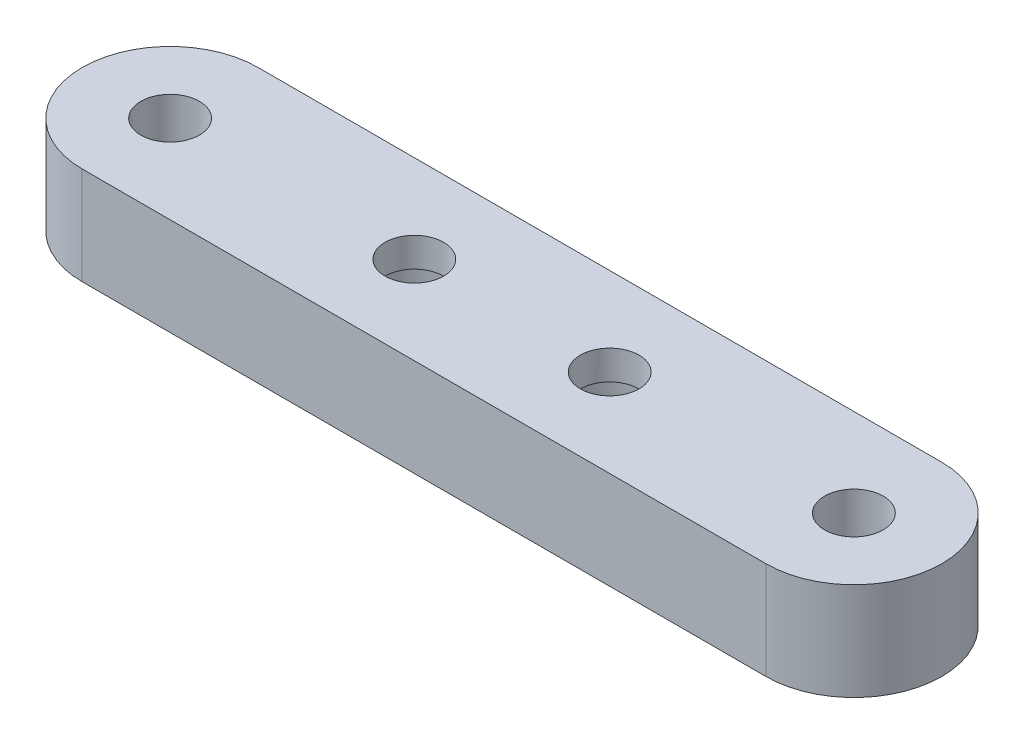
ISO-10303-21;
HEADER;
FILE_DESCRIPTION(('STEP AP214'),'2;1');
FILE_NAME('part.step','',(''),(''),'','','');
FILE_SCHEMA(('AUTOMOTIVE_DESIGN { 1 0 10303 214 1 1 1 1 }'));
ENDSEC;
DATA;
#1=APPLICATION_CONTEXT('core data for automotive mechanical design processes');
#2=APPLICATION_PROTOCOL_DEFINITION('international standard','automotive_design',2000,#1);
#3=PRODUCT_CONTEXT('',#1,'mechanical');
#4=PRODUCT('Part','Part','',(#3));
#5=PRODUCT_RELATED_PRODUCT_CATEGORY('part','',(#4));
#6=PRODUCT_DEFINITION_FORMATION('','',#4);
#7=PRODUCT_DEFINITION_CONTEXT('part definition',#1,'design');
#8=PRODUCT_DEFINITION('design','',#6,#7);
#9=PRODUCT_DEFINITION_SHAPE('','',#8);
#10=(LENGTH_UNIT() NAMED_UNIT(*) SI_UNIT(.MILLI.,.METRE.));
#11=(NAMED_UNIT(*) PLANE_ANGLE_UNIT() SI_UNIT($,.RADIAN.));
#12=(NAMED_UNIT(*) SI_UNIT($,.STERADIAN.) SOLID_ANGLE_UNIT());
#13=UNCERTAINTY_MEASURE_WITH_UNIT(LENGTH_MEASURE(1.E-05),#10,'distance_accuracy_value','');
#14=(GEOMETRIC_REPRESENTATION_CONTEXT(3) GLOBAL_UNCERTAINTY_ASSIGNED_CONTEXT((#13)) GLOBAL_UNIT_ASSIGNED_CONTEXT((#10,
#11,#12)) REPRESENTATION_CONTEXT('',''));
#15=CARTESIAN_POINT('',(0.,0.,0.));
#16=DIRECTION('',(0.,0.,1.));
#17=DIRECTION('',(1.,0.,0.));
#18=AXIS2_PLACEMENT_3D('',#15,#16,#17);
#19=CARTESIAN_POINT('',(-20.,10.,0.));
#20=DIRECTION('',(0.,-1.,0.));
#21=DIRECTION('',(0.,0.,-1.));
#22=AXIS2_PLACEMENT_3D('',#19,#20,#21);
#23=CYLINDRICAL_SURFACE('',#22,3.);
#24=CARTESIAN_POINT('',(-20.,10.,0.));
#25=DIRECTION('',(0.,1.,0.));
#26=DIRECTION('',(0.,0.,1.));
#27=AXIS2_PLACEMENT_3D('',#24,#25,#26);
#28=CIRCLE('',#27,3.);
#29=CARTESIAN_POINT('',(-20.,10.,3.));
#30=VERTEX_POINT('',#29);
#31=EDGE_CURVE('E121',#30,#30,#28,.T.);
#32=ORIENTED_EDGE('',*,*,#31,.T.);
#33=EDGE_LOOP('',(#32));
#34=FACE_BOUND('',#33,.T.);
#35=CARTESIAN_POINT('',(-20.,7.,0.));
#36=DIRECTION('',(0.,-1.,0.));
#37=DIRECTION('',(0.,0.,-1.));
#38=AXIS2_PLACEMENT_3D('',#35,#36,#37);
#39=CIRCLE('',#38,3.);
#40=CARTESIAN_POINT('',(-20.,7.,-3.));
#41=VERTEX_POINT('',#40);
#42=EDGE_CURVE('E49',#41,#41,#39,.T.);
#43=ORIENTED_EDGE('',*,*,#42,.T.);
#44=EDGE_LOOP('',(#43));
#45=FACE_BOUND('',#44,.T.);
#46=ADVANCED_FACE('F45',(#34,#45),#23,.F.);
#47=CARTESIAN_POINT('',(0.,10.,0.));
#48=DIRECTION('',(0.,-1.,0.));
#49=DIRECTION('',(0.,0.,-1.));
#50=AXIS2_PLACEMENT_3D('',#47,#48,#49);
#51=CYLINDRICAL_SURFACE('',#50,3.);
#52=CARTESIAN_POINT('',(0.,10.,0.));
#53=DIRECTION('',(0.,1.,0.));
#54=DIRECTION('',(0.,0.,1.));
#55=AXIS2_PLACEMENT_3D('',#52,#53,#54);
#56=CIRCLE('',#55,3.);
#57=CARTESIAN_POINT('',(0.,10.,3.));
#58=VERTEX_POINT('',#57);
#59=EDGE_CURVE('E114',#58,#58,#56,.T.);
#60=ORIENTED_EDGE('',*,*,#59,.T.);
#61=EDGE_LOOP('',(#60));
#62=FACE_BOUND('',#61,.T.);
#63=CARTESIAN_POINT('',(0.,7.,0.));
#64=DIRECTION('',(0.,-1.,0.));
#65=DIRECTION('',(0.,0.,-1.));
#66=AXIS2_PLACEMENT_3D('',#63,#64,#65);
#67=CIRCLE('',#66,3.);
#68=CARTESIAN_POINT('',(0.,7.,-3.));
#69=VERTEX_POINT('',#68);
#70=EDGE_CURVE('E152',#69,#69,#67,.T.);
#71=ORIENTED_EDGE('',*,*,#70,.T.);
#72=EDGE_LOOP('',(#71));
#73=FACE_BOUND('',#72,.T.);
#74=ADVANCED_FACE('F200',(#62,#73),#51,.F.);
#75=CARTESIAN_POINT('',(-45.,10.,0.));
#76=DIRECTION('',(0.,-1.,0.));
#77=DIRECTION('',(0.,0.,-1.));
#78=AXIS2_PLACEMENT_3D('',#75,#76,#77);
#79=CYLINDRICAL_SURFACE('',#78,9.);
#80=CARTESIAN_POINT('',(-45.,0.,0.));
#81=DIRECTION('',(0.,1.,0.));
#82=DIRECTION('',(0.,0.,1.));
#83=AXIS2_PLACEMENT_3D('',#80,#81,#82);
#84=CIRCLE('',#83,9.);
#85=CARTESIAN_POINT('',(-45.,0.,-9.));
#86=VERTEX_POINT('',#85);
#87=CARTESIAN_POINT('',(-45.,0.,9.));
#88=VERTEX_POINT('',#87);
#89=EDGE_CURVE('E134',#86,#88,#84,.T.);
#90=ORIENTED_EDGE('',*,*,#89,.T.);
#91=DIRECTION('',(0.,-1.,0.));
#92=VECTOR('',#91,1.);
#93=CARTESIAN_POINT('',(-45.,10.,9.));
#94=LINE('',#93,#92);
#95=CARTESIAN_POINT('',(-45.,10.,9.));
#96=VERTEX_POINT('',#95);
#97=EDGE_CURVE('E11',#96,#88,#94,.T.);
#98=ORIENTED_EDGE('',*,*,#97,.F.);
#99=CARTESIAN_POINT('',(-45.,10.,0.));
#100=DIRECTION('',(0.,1.,0.));
#101=DIRECTION('',(0.,0.,1.));
#102=AXIS2_PLACEMENT_3D('',#99,#100,#101);
#103=CIRCLE('',#102,9.);
#104=CARTESIAN_POINT('',(-45.,10.,-9.));
#105=VERTEX_POINT('',#104);
#106=EDGE_CURVE('E101',#105,#96,#103,.T.);
#107=ORIENTED_EDGE('',*,*,#106,.F.);
#108=DIRECTION('',(0.,-1.,0.));
#109=VECTOR('',#108,1.);
#110=CARTESIAN_POINT('',(-45.,10.,-9.));
#111=LINE('',#110,#109);
#112=EDGE_CURVE('E129',#105,#86,#111,.T.);
#113=ORIENTED_EDGE('',*,*,#112,.T.);
#114=EDGE_LOOP('',(#90,#98,#107,#113));
#115=FACE_BOUND('',#114,.T.);
#116=ADVANCED_FACE('F206',(#115),#79,.T.);
#117=CARTESIAN_POINT('',(0.,10.,9.));
#118=DIRECTION('',(0.,0.,-1.));
#119=DIRECTION('',(-1.,0.,0.));
#120=AXIS2_PLACEMENT_3D('',#117,#118,#119);
#121=PLANE('',#120);
#122=DIRECTION('',(1.,0.,0.));
#123=VECTOR('',#122,1.);
#124=CARTESIAN_POINT('',(0.,0.,9.));
#125=LINE('',#124,#123);
#126=CARTESIAN_POINT('',(25.,0.,9.));
#127=VERTEX_POINT('',#126);
#128=EDGE_CURVE('E106',#88,#127,#125,.T.);
#129=ORIENTED_EDGE('',*,*,#128,.T.);
#130=DIRECTION('',(0.,-1.,0.));
#131=VECTOR('',#130,1.);
#132=CARTESIAN_POINT('',(25.,10.,9.));
#133=LINE('',#132,#131);
#134=CARTESIAN_POINT('',(25.,10.,9.));
#135=VERTEX_POINT('',#134);
#136=EDGE_CURVE('E56',#135,#127,#133,.T.);
#137=ORIENTED_EDGE('',*,*,#136,.F.);
#138=DIRECTION('',(1.,0.,0.));
#139=VECTOR('',#138,1.);
#140=CARTESIAN_POINT('',(0.,10.,9.));
#141=LINE('',#140,#139);
#142=EDGE_CURVE('E95',#96,#135,#141,.T.);
#143=ORIENTED_EDGE('',*,*,#142,.F.);
#144=ORIENTED_EDGE('',*,*,#97,.T.);
#145=EDGE_LOOP('',(#129,#137,#143,#144));
#146=FACE_BOUND('',#145,.T.);
#147=ADVANCED_FACE('F105',(#146),#121,.F.);
#148=CARTESIAN_POINT('',(25.,10.,0.));
#149=DIRECTION('',(0.,-1.,0.));
#150=DIRECTION('',(0.,0.,-1.));
#151=AXIS2_PLACEMENT_3D('',#148,#149,#150);
#152=CYLINDRICAL_SURFACE('',#151,9.);
#153=CARTESIAN_POINT('',(25.,0.,0.));
#154=DIRECTION('',(0.,1.,0.));
#155=DIRECTION('',(0.,0.,1.));
#156=AXIS2_PLACEMENT_3D('',#153,#154,#155);
#157=CIRCLE('',#156,9.);
#158=CARTESIAN_POINT('',(25.,0.,-9.));
#159=VERTEX_POINT('',#158);
#160=EDGE_CURVE('E82',#127,#159,#157,.T.);
#161=ORIENTED_EDGE('',*,*,#160,.T.);
#162=DIRECTION('',(0.,-1.,0.));
#163=VECTOR('',#162,1.);
#164=CARTESIAN_POINT('',(25.,10.,-9.));
#165=LINE('',#164,#163);
#166=CARTESIAN_POINT('',(25.,10.,-9.));
#167=VERTEX_POINT('',#166);
#168=EDGE_CURVE('E108',#167,#159,#165,.T.);
#169=ORIENTED_EDGE('',*,*,#168,.F.);
#170=CARTESIAN_POINT('',(25.,10.,0.));
#171=DIRECTION('',(0.,1.,0.));
#172=DIRECTION('',(0.,0.,1.));
#173=AXIS2_PLACEMENT_3D('',#170,#171,#172);
#174=CIRCLE('',#173,9.);
#175=EDGE_CURVE('E99',#135,#167,#174,.T.);
#176=ORIENTED_EDGE('',*,*,#175,.F.);
#177=ORIENTED_EDGE('',*,*,#136,.T.);
#178=EDGE_LOOP('',(#161,#169,#176,#177));
#179=FACE_BOUND('',#178,.T.);
#180=ADVANCED_FACE('F110',(#179),#152,.T.);
#181=CARTESIAN_POINT('',(0.,10.,-9.));
#182=DIRECTION('',(0.,0.,1.));
#183=DIRECTION('',(1.,0.,0.));
#184=AXIS2_PLACEMENT_3D('',#181,#182,#183);
#185=PLANE('',#184);
#186=DIRECTION('',(-1.,0.,0.));
#187=VECTOR('',#186,1.);
#188=CARTESIAN_POINT('',(0.,0.,-9.));
#189=LINE('',#188,#187);
#190=EDGE_CURVE('E88',#159,#86,#189,.T.);
#191=ORIENTED_EDGE('',*,*,#190,.T.);
#192=ORIENTED_EDGE('',*,*,#112,.F.);
#193=DIRECTION('',(-1.,0.,0.));
#194=VECTOR('',#193,1.);
#195=CARTESIAN_POINT('',(0.,10.,-9.));
#196=LINE('',#195,#194);
#197=EDGE_CURVE('E65',#167,#105,#196,.T.);
#198=ORIENTED_EDGE('',*,*,#197,.F.);
#199=ORIENTED_EDGE('',*,*,#168,.T.);
#200=EDGE_LOOP('',(#191,#192,#198,#199));
#201=FACE_BOUND('',#200,.T.);
#202=ADVANCED_FACE('F211',(#201),#185,.F.);
#203=CARTESIAN_POINT('',(-45.,10.,0.));
#204=DIRECTION('',(0.,-1.,0.));
#205=DIRECTION('',(0.,0.,-1.));
#206=AXIS2_PLACEMENT_3D('',#203,#204,#205);
#207=CYLINDRICAL_SURFACE('',#206,3.);
#208=CARTESIAN_POINT('',(-45.,10.,0.));
#209=DIRECTION('',(0.,1.,0.));
#210=DIRECTION('',(0.,0.,1.));
#211=AXIS2_PLACEMENT_3D('',#208,#209,#210);
#212=CIRCLE('',#211,3.);
#213=CARTESIAN_POINT('',(-45.,10.,3.));
#214=VERTEX_POINT('',#213);
#215=EDGE_CURVE('E148',#214,#214,#212,.T.);
#216=ORIENTED_EDGE('',*,*,#215,.T.);
#217=EDGE_LOOP('',(#216));
#218=FACE_BOUND('',#217,.T.);
#219=CARTESIAN_POINT('',(-45.,0.,0.));
#220=DIRECTION('',(0.,1.,0.));
#221=DIRECTION('',(0.,0.,1.));
#222=AXIS2_PLACEMENT_3D('',#219,#220,#221);
#223=CIRCLE('',#222,3.);
#224=CARTESIAN_POINT('',(-45.,0.,3.));
#225=VERTEX_POINT('',#224);
#226=EDGE_CURVE('E130',#225,#225,#223,.T.);
#227=ORIENTED_EDGE('',*,*,#226,.F.);
#228=EDGE_LOOP('',(#227));
#229=FACE_BOUND('',#228,.T.);
#230=ADVANCED_FACE('F47',(#218,#229),#207,.F.);
#231=CARTESIAN_POINT('',(25.,10.,0.));
#232=DIRECTION('',(0.,-1.,0.));
#233=DIRECTION('',(0.,0.,-1.));
#234=AXIS2_PLACEMENT_3D('',#231,#232,#233);
#235=CYLINDRICAL_SURFACE('',#234,3.);
#236=CARTESIAN_POINT('',(25.,10.,0.));
#237=DIRECTION('',(0.,1.,0.));
#238=DIRECTION('',(0.,0.,1.));
#239=AXIS2_PLACEMENT_3D('',#236,#237,#238);
#240=CIRCLE('',#239,3.);
#241=CARTESIAN_POINT('',(25.,10.,3.));
#242=VERTEX_POINT('',#241);
#243=EDGE_CURVE('E125',#242,#242,#240,.T.);
#244=ORIENTED_EDGE('',*,*,#243,.T.);
#245=EDGE_LOOP('',(#244));
#246=FACE_BOUND('',#245,.T.);
#247=CARTESIAN_POINT('',(25.,0.,0.));
#248=DIRECTION('',(0.,1.,0.));
#249=DIRECTION('',(0.,0.,1.));
#250=AXIS2_PLACEMENT_3D('',#247,#248,#249);
#251=CIRCLE('',#250,3.);
#252=CARTESIAN_POINT('',(25.,0.,3.));
#253=VERTEX_POINT('',#252);
#254=EDGE_CURVE('E144',#253,#253,#251,.T.);
#255=ORIENTED_EDGE('',*,*,#254,.F.);
#256=EDGE_LOOP('',(#255));
#257=FACE_BOUND('',#256,.T.);
#258=ADVANCED_FACE('F187',(#246,#257),#235,.F.);
#259=CARTESIAN_POINT('',(0.,10.,0.));
#260=DIRECTION('',(0.,1.,0.));
#261=DIRECTION('',(0.,0.,1.));
#262=AXIS2_PLACEMENT_3D('',#259,#260,#261);
#263=PLANE('',#262);
#264=ORIENTED_EDGE('',*,*,#215,.F.);
#265=EDGE_LOOP('',(#264));
#266=FACE_BOUND('',#265,.T.);
#267=ORIENTED_EDGE('',*,*,#106,.T.);
#268=ORIENTED_EDGE('',*,*,#142,.T.);
#269=ORIENTED_EDGE('',*,*,#175,.T.);
#270=ORIENTED_EDGE('',*,*,#197,.T.);
#271=EDGE_LOOP('',(#267,#268,#269,#270));
#272=FACE_BOUND('',#271,.T.);
#273=ORIENTED_EDGE('',*,*,#59,.F.);
#274=EDGE_LOOP('',(#273));
#275=FACE_BOUND('',#274,.T.);
#276=ORIENTED_EDGE('',*,*,#31,.F.);
#277=EDGE_LOOP('',(#276));
#278=FACE_BOUND('',#277,.T.);
#279=ORIENTED_EDGE('',*,*,#243,.F.);
#280=EDGE_LOOP('',(#279));
#281=FACE_BOUND('',#280,.T.);
#282=ADVANCED_FACE('F96',(#266,#272,#275,#278,#281),#263,.T.);
#283=CARTESIAN_POINT('',(0.,0.,0.));
#284=DIRECTION('',(0.,1.,0.));
#285=DIRECTION('',(0.,0.,1.));
#286=AXIS2_PLACEMENT_3D('',#283,#284,#285);
#287=PLANE('',#286);
#288=CARTESIAN_POINT('',(-20.,0.,0.));
#289=DIRECTION('',(0.,-1.,0.));
#290=DIRECTION('',(0.,0.,-1.));
#291=AXIS2_PLACEMENT_3D('',#288,#289,#290);
#292=CIRCLE('',#291,5.);
#293=CARTESIAN_POINT('',(-20.,0.,-5.));
#294=VERTEX_POINT('',#293);
#295=EDGE_CURVE('E162',#294,#294,#292,.T.);
#296=ORIENTED_EDGE('',*,*,#295,.F.);
#297=EDGE_LOOP('',(#296));
#298=FACE_BOUND('',#297,.T.);
#299=CARTESIAN_POINT('',(0.,0.,0.));
#300=DIRECTION('',(0.,-1.,0.));
#301=DIRECTION('',(0.,0.,-1.));
#302=AXIS2_PLACEMENT_3D('',#299,#300,#301);
#303=CIRCLE('',#302,5.);
#304=CARTESIAN_POINT('',(0.,0.,-5.));
#305=VERTEX_POINT('',#304);
#306=EDGE_CURVE('E168',#305,#305,#303,.T.);
#307=ORIENTED_EDGE('',*,*,#306,.F.);
#308=EDGE_LOOP('',(#307));
#309=FACE_BOUND('',#308,.T.);
#310=ORIENTED_EDGE('',*,*,#226,.T.);
#311=EDGE_LOOP('',(#310));
#312=FACE_BOUND('',#311,.T.);
#313=ORIENTED_EDGE('',*,*,#89,.F.);
#314=ORIENTED_EDGE('',*,*,#190,.F.);
#315=ORIENTED_EDGE('',*,*,#160,.F.);
#316=ORIENTED_EDGE('',*,*,#128,.F.);
#317=EDGE_LOOP('',(#313,#314,#315,#316));
#318=FACE_BOUND('',#317,.T.);
#319=ORIENTED_EDGE('',*,*,#254,.T.);
#320=EDGE_LOOP('',(#319));
#321=FACE_BOUND('',#320,.T.);
#322=ADVANCED_FACE('F186',(#298,#309,#312,#318,#321),#287,.F.);
#323=CARTESIAN_POINT('',(0.,7.,0.));
#324=DIRECTION('',(0.,-1.,0.));
#325=DIRECTION('',(0.,0.,-1.));
#326=AXIS2_PLACEMENT_3D('',#323,#324,#325);
#327=CYLINDRICAL_SURFACE('',#326,5.);
#328=CARTESIAN_POINT('',(0.,7.,0.));
#329=DIRECTION('',(0.,-1.,0.));
#330=DIRECTION('',(0.,0.,-1.));
#331=AXIS2_PLACEMENT_3D('',#328,#329,#330);
#332=CIRCLE('',#331,5.);
#333=CARTESIAN_POINT('',(0.,7.,-5.));
#334=VERTEX_POINT('',#333);
#335=EDGE_CURVE('E174',#334,#334,#332,.T.);
#336=ORIENTED_EDGE('',*,*,#335,.F.);
#337=EDGE_LOOP('',(#336));
#338=FACE_BOUND('',#337,.T.);
#339=ORIENTED_EDGE('',*,*,#306,.T.);
#340=EDGE_LOOP('',(#339));
#341=FACE_BOUND('',#340,.T.);
#342=ADVANCED_FACE('F194',(#338,#341),#327,.F.);
#343=CARTESIAN_POINT('',(0.,7.,0.));
#344=DIRECTION('',(0.,-1.,0.));
#345=DIRECTION('',(0.,0.,-1.));
#346=AXIS2_PLACEMENT_3D('',#343,#344,#345);
#347=PLANE('',#346);
#348=ORIENTED_EDGE('',*,*,#70,.F.);
#349=EDGE_LOOP('',(#348));
#350=FACE_BOUND('',#349,.T.);
#351=ORIENTED_EDGE('',*,*,#335,.T.);
#352=EDGE_LOOP('',(#351));
#353=FACE_BOUND('',#352,.T.);
#354=ADVANCED_FACE('F293',(#350,#353),#347,.T.);
#355=CARTESIAN_POINT('',(-20.,7.,0.));
#356=DIRECTION('',(0.,-1.,0.));
#357=DIRECTION('',(0.,0.,-1.));
#358=AXIS2_PLACEMENT_3D('',#355,#356,#357);
#359=CYLINDRICAL_SURFACE('',#358,5.);
#360=CARTESIAN_POINT('',(-20.,7.,0.));
#361=DIRECTION('',(0.,-1.,0.));
#362=DIRECTION('',(0.,0.,-1.));
#363=AXIS2_PLACEMENT_3D('',#360,#361,#362);
#364=CIRCLE('',#363,5.);
#365=CARTESIAN_POINT('',(-20.,7.,-5.));
#366=VERTEX_POINT('',#365);
#367=EDGE_CURVE('E155',#366,#366,#364,.T.);
#368=ORIENTED_EDGE('',*,*,#367,.F.);
#369=EDGE_LOOP('',(#368));
#370=FACE_BOUND('',#369,.T.);
#371=ORIENTED_EDGE('',*,*,#295,.T.);
#372=EDGE_LOOP('',(#371));
#373=FACE_BOUND('',#372,.T.);
#374=ADVANCED_FACE('F303',(#370,#373),#359,.F.);
#375=CARTESIAN_POINT('',(-20.,7.,0.));
#376=DIRECTION('',(0.,-1.,0.));
#377=DIRECTION('',(0.,0.,-1.));
#378=AXIS2_PLACEMENT_3D('',#375,#376,#377);
#379=PLANE('',#378);
#380=ORIENTED_EDGE('',*,*,#42,.F.);
#381=EDGE_LOOP('',(#380));
#382=FACE_BOUND('',#381,.T.);
#383=ORIENTED_EDGE('',*,*,#367,.T.);
#384=EDGE_LOOP('',(#383));
#385=FACE_BOUND('',#384,.T.);
#386=ADVANCED_FACE('F312',(#382,#385),#379,.T.);
#387=CLOSED_SHELL('',(#46,#74,#116,#147,#180,#202,#230,#258,#282,#322,#342,#354,#374,#386));
#388=MANIFOLD_SOLID_BREP('B2',#387);
#389=ADVANCED_BREP_SHAPE_REPRESENTATION('',(#18,#388),#14);
#390=SHAPE_DEFINITION_REPRESENTATION(#9,#389);
ENDSEC;
END-ISO-10303-21;
